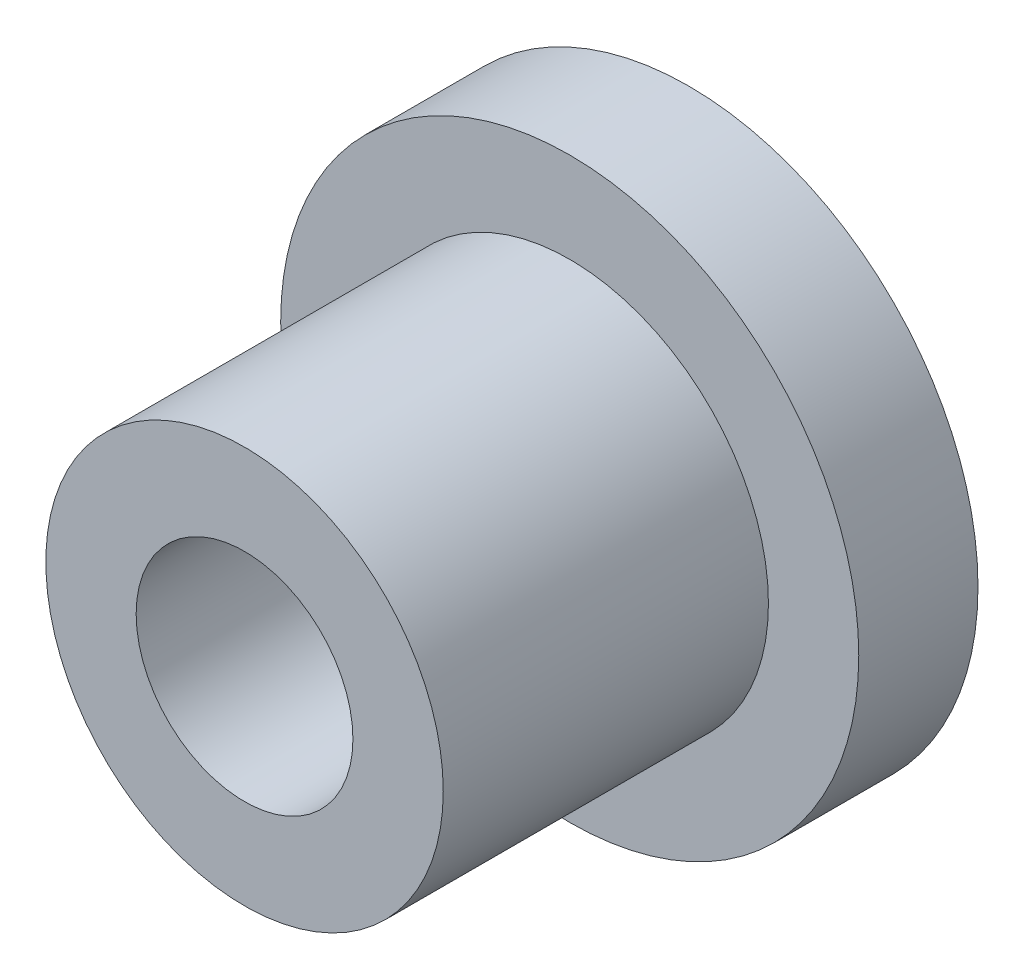
ISO-10303-21;
HEADER;
FILE_DESCRIPTION(('STEP AP214'),'2;1');
FILE_NAME('part.step','',(''),(''),'','','');
FILE_SCHEMA(('AUTOMOTIVE_DESIGN { 1 0 10303 214 1 1 1 1 }'));
ENDSEC;
DATA;
#1=APPLICATION_CONTEXT('core data for automotive mechanical design processes');
#2=APPLICATION_PROTOCOL_DEFINITION('international standard','automotive_design',2000,#1);
#3=PRODUCT_CONTEXT('',#1,'mechanical');
#4=PRODUCT('Part','Part','',(#3));
#5=PRODUCT_RELATED_PRODUCT_CATEGORY('part','',(#4));
#6=PRODUCT_DEFINITION_FORMATION('','',#4);
#7=PRODUCT_DEFINITION_CONTEXT('part definition',#1,'design');
#8=PRODUCT_DEFINITION('design','',#6,#7);
#9=PRODUCT_DEFINITION_SHAPE('','',#8);
#10=(LENGTH_UNIT() NAMED_UNIT(*) SI_UNIT(.MILLI.,.METRE.));
#11=(NAMED_UNIT(*) PLANE_ANGLE_UNIT() SI_UNIT($,.RADIAN.));
#12=(NAMED_UNIT(*) SI_UNIT($,.STERADIAN.) SOLID_ANGLE_UNIT());
#13=UNCERTAINTY_MEASURE_WITH_UNIT(LENGTH_MEASURE(1.E-05),#10,'distance_accuracy_value','');
#14=(GEOMETRIC_REPRESENTATION_CONTEXT(3) GLOBAL_UNCERTAINTY_ASSIGNED_CONTEXT((#13)) GLOBAL_UNIT_ASSIGNED_CONTEXT((#10,
#11,#12)) REPRESENTATION_CONTEXT('',''));
#15=CARTESIAN_POINT('',(0.,0.,0.));
#16=DIRECTION('',(0.,0.,1.));
#17=DIRECTION('',(1.,0.,0.));
#18=AXIS2_PLACEMENT_3D('',#15,#16,#17);
#19=CARTESIAN_POINT('',(0.,5.5,0.));
#20=DIRECTION('',(0.,0.,-1.));
#21=DIRECTION('',(-1.,0.,0.));
#22=AXIS2_PLACEMENT_3D('',#19,#20,#21);
#23=PLANE('',#22);
#24=CARTESIAN_POINT('',(0.,0.,0.));
#25=DIRECTION('',(0.,0.,1.));
#26=DIRECTION('',(1.,0.,0.));
#27=AXIS2_PLACEMENT_3D('',#24,#25,#26);
#28=CIRCLE('',#27,3.);
#29=CARTESIAN_POINT('',(3.,0.,0.));
#30=VERTEX_POINT('',#29);
#31=EDGE_CURVE('E10',#30,#30,#28,.T.);
#32=ORIENTED_EDGE('',*,*,#31,.F.);
#33=EDGE_LOOP('',(#32));
#34=FACE_BOUND('',#33,.T.);
#35=CARTESIAN_POINT('',(0.,0.,0.));
#36=DIRECTION('',(0.,0.,1.));
#37=DIRECTION('',(1.,0.,0.));
#38=AXIS2_PLACEMENT_3D('',#35,#36,#37);
#39=CIRCLE('',#38,5.5);
#40=CARTESIAN_POINT('',(5.5,0.,0.));
#41=VERTEX_POINT('',#40);
#42=EDGE_CURVE('E56',#41,#41,#39,.T.);
#43=ORIENTED_EDGE('',*,*,#42,.T.);
#44=EDGE_LOOP('',(#43));
#45=FACE_BOUND('',#44,.T.);
#46=ADVANCED_FACE('F31',(#34,#45),#23,.F.);
#47=CARTESIAN_POINT('',(0.,0.,0.));
#48=DIRECTION('',(0.,0.,1.));
#49=DIRECTION('',(1.,0.,0.));
#50=AXIS2_PLACEMENT_3D('',#47,#48,#49);
#51=CYLINDRICAL_SURFACE('',#50,3.);
#52=CARTESIAN_POINT('',(0.,0.,-9.));
#53=DIRECTION('',(0.,0.,1.));
#54=DIRECTION('',(1.,0.,0.));
#55=AXIS2_PLACEMENT_3D('',#52,#53,#54);
#56=CIRCLE('',#55,3.);
#57=CARTESIAN_POINT('',(3.,0.,-9.));
#58=VERTEX_POINT('',#57);
#59=EDGE_CURVE('E37',#58,#58,#56,.T.);
#60=ORIENTED_EDGE('',*,*,#59,.F.);
#61=EDGE_LOOP('',(#60));
#62=FACE_BOUND('',#61,.T.);
#63=ORIENTED_EDGE('',*,*,#31,.T.);
#64=EDGE_LOOP('',(#63));
#65=FACE_BOUND('',#64,.T.);
#66=ADVANCED_FACE('F87',(#62,#65),#51,.F.);
#67=CARTESIAN_POINT('',(0.,0.,-9.));
#68=DIRECTION('',(0.,0.,-1.));
#69=DIRECTION('',(-1.,0.,0.));
#70=AXIS2_PLACEMENT_3D('',#67,#68,#69);
#71=CONICAL_SURFACE('',#70,3.,0.78539816339745);
#72=CARTESIAN_POINT('',(0.,0.,-12.3));
#73=DIRECTION('',(0.,0.,1.));
#74=DIRECTION('',(1.,0.,0.));
#75=AXIS2_PLACEMENT_3D('',#72,#73,#74);
#76=CIRCLE('',#75,6.30000000000001);
#77=CARTESIAN_POINT('',(6.30000000000001,0.,-12.3));
#78=VERTEX_POINT('',#77);
#79=EDGE_CURVE('E41',#78,#78,#76,.T.);
#80=ORIENTED_EDGE('',*,*,#79,.F.);
#81=EDGE_LOOP('',(#80));
#82=FACE_BOUND('',#81,.T.);
#83=ORIENTED_EDGE('',*,*,#59,.T.);
#84=EDGE_LOOP('',(#83));
#85=FACE_BOUND('',#84,.T.);
#86=ADVANCED_FACE('F82',(#82,#85),#71,.F.);
#87=CARTESIAN_POINT('',(0.,6.30000000000001,-12.3));
#88=DIRECTION('',(0.,0.,1.));
#89=DIRECTION('',(1.,0.,0.));
#90=AXIS2_PLACEMENT_3D('',#87,#88,#89);
#91=PLANE('',#90);
#92=CARTESIAN_POINT('',(0.,0.,-12.3));
#93=DIRECTION('',(0.,0.,1.));
#94=DIRECTION('',(1.,0.,0.));
#95=AXIS2_PLACEMENT_3D('',#92,#93,#94);
#96=CIRCLE('',#95,8.);
#97=CARTESIAN_POINT('',(8.,0.,-12.3));
#98=VERTEX_POINT('',#97);
#99=EDGE_CURVE('E45',#98,#98,#96,.T.);
#100=ORIENTED_EDGE('',*,*,#99,.F.);
#101=EDGE_LOOP('',(#100));
#102=FACE_BOUND('',#101,.T.);
#103=ORIENTED_EDGE('',*,*,#79,.T.);
#104=EDGE_LOOP('',(#103));
#105=FACE_BOUND('',#104,.T.);
#106=ADVANCED_FACE('F76',(#102,#105),#91,.F.);
#107=CARTESIAN_POINT('',(0.,0.,0.));
#108=DIRECTION('',(0.,0.,1.));
#109=DIRECTION('',(1.,0.,0.));
#110=AXIS2_PLACEMENT_3D('',#107,#108,#109);
#111=CYLINDRICAL_SURFACE('',#110,8.);
#112=CARTESIAN_POINT('',(0.,0.,-9.));
#113=DIRECTION('',(0.,0.,1.));
#114=DIRECTION('',(1.,0.,0.));
#115=AXIS2_PLACEMENT_3D('',#112,#113,#114);
#116=CIRCLE('',#115,8.);
#117=CARTESIAN_POINT('',(8.,0.,-9.));
#118=VERTEX_POINT('',#117);
#119=EDGE_CURVE('E50',#118,#118,#116,.T.);
#120=ORIENTED_EDGE('',*,*,#119,.F.);
#121=EDGE_LOOP('',(#120));
#122=FACE_BOUND('',#121,.T.);
#123=ORIENTED_EDGE('',*,*,#99,.T.);
#124=EDGE_LOOP('',(#123));
#125=FACE_BOUND('',#124,.T.);
#126=ADVANCED_FACE('F70',(#122,#125),#111,.T.);
#127=CARTESIAN_POINT('',(0.,8.,-9.));
#128=DIRECTION('',(0.,0.,-1.));
#129=DIRECTION('',(-1.,0.,0.));
#130=AXIS2_PLACEMENT_3D('',#127,#128,#129);
#131=PLANE('',#130);
#132=CARTESIAN_POINT('',(0.,0.,-9.));
#133=DIRECTION('',(0.,0.,1.));
#134=DIRECTION('',(1.,0.,0.));
#135=AXIS2_PLACEMENT_3D('',#132,#133,#134);
#136=CIRCLE('',#135,5.5);
#137=CARTESIAN_POINT('',(5.5,0.,-9.));
#138=VERTEX_POINT('',#137);
#139=EDGE_CURVE('E53',#138,#138,#136,.T.);
#140=ORIENTED_EDGE('',*,*,#139,.F.);
#141=EDGE_LOOP('',(#140));
#142=FACE_BOUND('',#141,.T.);
#143=ORIENTED_EDGE('',*,*,#119,.T.);
#144=EDGE_LOOP('',(#143));
#145=FACE_BOUND('',#144,.T.);
#146=ADVANCED_FACE('F64',(#142,#145),#131,.F.);
#147=CARTESIAN_POINT('',(0.,0.,0.));
#148=DIRECTION('',(0.,0.,1.));
#149=DIRECTION('',(1.,0.,0.));
#150=AXIS2_PLACEMENT_3D('',#147,#148,#149);
#151=CYLINDRICAL_SURFACE('',#150,5.5);
#152=ORIENTED_EDGE('',*,*,#42,.F.);
#153=EDGE_LOOP('',(#152));
#154=FACE_BOUND('',#153,.T.);
#155=ORIENTED_EDGE('',*,*,#139,.T.);
#156=EDGE_LOOP('',(#155));
#157=FACE_BOUND('',#156,.T.);
#158=ADVANCED_FACE('F61',(#154,#157),#151,.T.);
#159=CLOSED_SHELL('',(#46,#66,#86,#106,#126,#146,#158));
#160=MANIFOLD_SOLID_BREP('B2',#159);
#161=ADVANCED_BREP_SHAPE_REPRESENTATION('',(#18,#160),#14);
#162=SHAPE_DEFINITION_REPRESENTATION(#9,#161);
ENDSEC;
END-ISO-10303-21;
